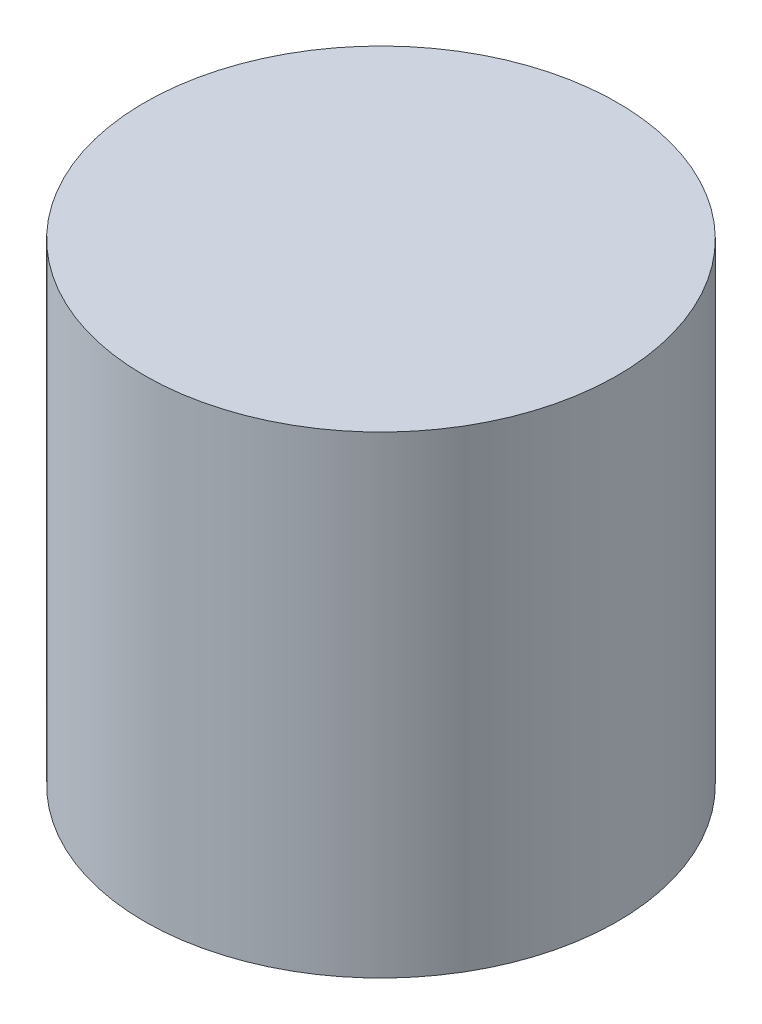
ISO-10303-21;
HEADER;
FILE_DESCRIPTION(('STEP AP214'),'2;1');
FILE_NAME('part.step','',(''),(''),'','','');
FILE_SCHEMA(('AUTOMOTIVE_DESIGN { 1 0 10303 214 1 1 1 1 }'));
ENDSEC;
DATA;
#1=APPLICATION_CONTEXT('core data for automotive mechanical design processes');
#2=APPLICATION_PROTOCOL_DEFINITION('international standard','automotive_design',2000,#1);
#3=PRODUCT_CONTEXT('',#1,'mechanical');
#4=PRODUCT('Part','Part','',(#3));
#5=PRODUCT_RELATED_PRODUCT_CATEGORY('part','',(#4));
#6=PRODUCT_DEFINITION_FORMATION('','',#4);
#7=PRODUCT_DEFINITION_CONTEXT('part definition',#1,'design');
#8=PRODUCT_DEFINITION('design','',#6,#7);
#9=PRODUCT_DEFINITION_SHAPE('','',#8);
#10=(LENGTH_UNIT() NAMED_UNIT(*) SI_UNIT(.MILLI.,.METRE.));
#11=(NAMED_UNIT(*) PLANE_ANGLE_UNIT() SI_UNIT($,.RADIAN.));
#12=(NAMED_UNIT(*) SI_UNIT($,.STERADIAN.) SOLID_ANGLE_UNIT());
#13=UNCERTAINTY_MEASURE_WITH_UNIT(LENGTH_MEASURE(1.E-05),#10,'distance_accuracy_value','');
#14=(GEOMETRIC_REPRESENTATION_CONTEXT(3) GLOBAL_UNCERTAINTY_ASSIGNED_CONTEXT((#13)) GLOBAL_UNIT_ASSIGNED_CONTEXT((#10,
#11,#12)) REPRESENTATION_CONTEXT('',''));
#15=CARTESIAN_POINT('',(0.,0.,0.));
#16=DIRECTION('',(0.,0.,1.));
#17=DIRECTION('',(1.,0.,0.));
#18=AXIS2_PLACEMENT_3D('',#15,#16,#17);
#19=CARTESIAN_POINT('',(0.,19.05,0.));
#20=DIRECTION('',(0.,-1.,0.));
#21=DIRECTION('',(0.,0.,-1.));
#22=AXIS2_PLACEMENT_3D('',#19,#20,#21);
#23=CYLINDRICAL_SURFACE('',#22,9.525);
#24=CARTESIAN_POINT('',(0.,19.05,0.));
#25=DIRECTION('',(0.,1.,0.));
#26=DIRECTION('',(0.,0.,1.));
#27=AXIS2_PLACEMENT_3D('',#24,#25,#26);
#28=CIRCLE('',#27,9.525);
#29=CARTESIAN_POINT('',(0.,19.05,9.525));
#30=VERTEX_POINT('',#29);
#31=EDGE_CURVE('E10',#30,#30,#28,.T.);
#32=ORIENTED_EDGE('',*,*,#31,.F.);
#33=EDGE_LOOP('',(#32));
#34=FACE_BOUND('',#33,.T.);
#35=CARTESIAN_POINT('',(0.,0.,0.));
#36=DIRECTION('',(0.,1.,0.));
#37=DIRECTION('',(0.,0.,1.));
#38=AXIS2_PLACEMENT_3D('',#35,#36,#37);
#39=CIRCLE('',#38,9.525);
#40=CARTESIAN_POINT('',(0.,0.,9.525));
#41=VERTEX_POINT('',#40);
#42=EDGE_CURVE('E39',#41,#41,#39,.T.);
#43=ORIENTED_EDGE('',*,*,#42,.T.);
#44=EDGE_LOOP('',(#43));
#45=FACE_BOUND('',#44,.T.);
#46=ADVANCED_FACE('F36',(#34,#45),#23,.T.);
#47=CARTESIAN_POINT('',(0.,19.05,0.));
#48=DIRECTION('',(0.,1.,0.));
#49=DIRECTION('',(0.,0.,1.));
#50=AXIS2_PLACEMENT_3D('',#47,#48,#49);
#51=PLANE('',#50);
#52=ORIENTED_EDGE('',*,*,#31,.T.);
#53=EDGE_LOOP('',(#52));
#54=FACE_BOUND('',#53,.T.);
#55=ADVANCED_FACE('F51',(#54),#51,.T.);
#56=CARTESIAN_POINT('',(0.,0.,0.));
#57=DIRECTION('',(0.,1.,0.));
#58=DIRECTION('',(0.,0.,1.));
#59=AXIS2_PLACEMENT_3D('',#56,#57,#58);
#60=PLANE('',#59);
#61=ORIENTED_EDGE('',*,*,#42,.F.);
#62=EDGE_LOOP('',(#61));
#63=FACE_BOUND('',#62,.T.);
#64=ADVANCED_FACE('F49',(#63),#60,.F.);
#65=CLOSED_SHELL('',(#46,#55,#64));
#66=MANIFOLD_SOLID_BREP('B2',#65);
#67=ADVANCED_BREP_SHAPE_REPRESENTATION('',(#18,#66),#14);
#68=SHAPE_DEFINITION_REPRESENTATION(#9,#67);
ENDSEC;
END-ISO-10303-21;
